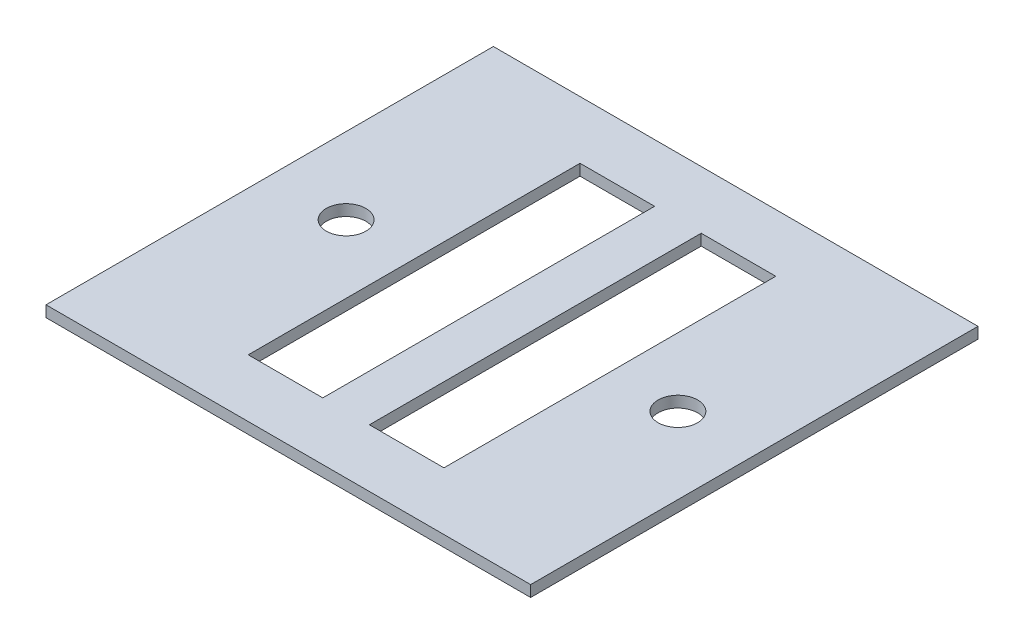
ISO-10303-21;
HEADER;
FILE_DESCRIPTION(('STEP AP214'),'2;1');
FILE_NAME('part.step','',(''),(''),'','','');
FILE_SCHEMA(('AUTOMOTIVE_DESIGN { 1 0 10303 214 1 1 1 1 }'));
ENDSEC;
DATA;
#1=APPLICATION_CONTEXT('core data for automotive mechanical design processes');
#2=APPLICATION_PROTOCOL_DEFINITION('international standard','automotive_design',2000,#1);
#3=PRODUCT_CONTEXT('',#1,'mechanical');
#4=PRODUCT('Part','Part','',(#3));
#5=PRODUCT_RELATED_PRODUCT_CATEGORY('part','',(#4));
#6=PRODUCT_DEFINITION_FORMATION('','',#4);
#7=PRODUCT_DEFINITION_CONTEXT('part definition',#1,'design');
#8=PRODUCT_DEFINITION('design','',#6,#7);
#9=PRODUCT_DEFINITION_SHAPE('','',#8);
#10=(LENGTH_UNIT() NAMED_UNIT(*) SI_UNIT(.MILLI.,.METRE.));
#11=(NAMED_UNIT(*) PLANE_ANGLE_UNIT() SI_UNIT($,.RADIAN.));
#12=(NAMED_UNIT(*) SI_UNIT($,.STERADIAN.) SOLID_ANGLE_UNIT());
#13=UNCERTAINTY_MEASURE_WITH_UNIT(LENGTH_MEASURE(1.E-05),#10,'distance_accuracy_value','');
#14=(GEOMETRIC_REPRESENTATION_CONTEXT(3) GLOBAL_UNCERTAINTY_ASSIGNED_CONTEXT((#13)) GLOBAL_UNIT_ASSIGNED_CONTEXT((#10,
#11,#12)) REPRESENTATION_CONTEXT('',''));
#15=CARTESIAN_POINT('',(0.,0.,0.));
#16=DIRECTION('',(0.,0.,1.));
#17=DIRECTION('',(1.,0.,0.));
#18=AXIS2_PLACEMENT_3D('',#15,#16,#17);
#19=CARTESIAN_POINT('',(0.,3.,0.));
#20=DIRECTION('',(0.,-1.,0.));
#21=DIRECTION('',(0.,0.,-1.));
#22=AXIS2_PLACEMENT_3D('',#19,#20,#21);
#23=PLANE('',#22);
#24=CARTESIAN_POINT('',(-44.5,3.,0.));
#25=DIRECTION('',(0.,-1.,0.));
#26=DIRECTION('',(0.,0.,-1.));
#27=AXIS2_PLACEMENT_3D('',#24,#25,#26);
#28=CIRCLE('',#27,5.3);
#29=CARTESIAN_POINT('',(-44.5,3.,-5.3));
#30=VERTEX_POINT('',#29);
#31=EDGE_CURVE('E313',#30,#30,#28,.F.);
#32=ORIENTED_EDGE('',*,*,#31,.F.);
#33=EDGE_LOOP('',(#32));
#34=FACE_BOUND('',#33,.T.);
#35=CARTESIAN_POINT('',(44.5,3.,0.));
#36=DIRECTION('',(0.,-1.,0.));
#37=DIRECTION('',(0.,0.,-1.));
#38=AXIS2_PLACEMENT_3D('',#35,#36,#37);
#39=CIRCLE('',#38,5.3);
#40=CARTESIAN_POINT('',(44.5,3.,-5.3));
#41=VERTEX_POINT('',#40);
#42=EDGE_CURVE('E138',#41,#41,#39,.T.);
#43=ORIENTED_EDGE('',*,*,#42,.T.);
#44=EDGE_LOOP('',(#43));
#45=FACE_BOUND('',#44,.T.);
#46=DIRECTION('',(0.,0.,-1.));
#47=VECTOR('',#46,1.);
#48=CARTESIAN_POINT('',(65.,3.,60.));
#49=LINE('',#48,#47);
#50=CARTESIAN_POINT('',(65.,3.,60.));
#51=VERTEX_POINT('',#50);
#52=CARTESIAN_POINT('',(65.,3.,-60.));
#53=VERTEX_POINT('',#52);
#54=EDGE_CURVE('E196',#51,#53,#49,.T.);
#55=ORIENTED_EDGE('',*,*,#54,.T.);
#56=DIRECTION('',(-1.,0.,0.));
#57=VECTOR('',#56,1.);
#58=CARTESIAN_POINT('',(-65.,3.,-60.));
#59=LINE('',#58,#57);
#60=CARTESIAN_POINT('',(-65.,3.,-60.));
#61=VERTEX_POINT('',#60);
#62=EDGE_CURVE('E199',#53,#61,#59,.T.);
#63=ORIENTED_EDGE('',*,*,#62,.T.);
#64=DIRECTION('',(0.,0.,1.));
#65=VECTOR('',#64,1.);
#66=CARTESIAN_POINT('',(-65.,3.,60.));
#67=LINE('',#66,#65);
#68=CARTESIAN_POINT('',(-65.,3.,60.));
#69=VERTEX_POINT('',#68);
#70=EDGE_CURVE('E202',#61,#69,#67,.T.);
#71=ORIENTED_EDGE('',*,*,#70,.T.);
#72=DIRECTION('',(1.,0.,0.));
#73=VECTOR('',#72,1.);
#74=CARTESIAN_POINT('',(-65.,3.,60.));
#75=LINE('',#74,#73);
#76=EDGE_CURVE('E204',#69,#51,#75,.T.);
#77=ORIENTED_EDGE('',*,*,#76,.T.);
#78=EDGE_LOOP('',(#55,#63,#71,#77));
#79=FACE_BOUND('',#78,.T.);
#80=DIRECTION('',(1.,0.,0.));
#81=VECTOR('',#80,1.);
#82=CARTESIAN_POINT('',(0.,3.,-44.5));
#83=LINE('',#82,#81);
#84=CARTESIAN_POINT('',(-26.25,3.,-44.5));
#85=VERTEX_POINT('',#84);
#86=CARTESIAN_POINT('',(-6.25,3.,-44.5));
#87=VERTEX_POINT('',#86);
#88=EDGE_CURVE('E176',#85,#87,#83,.T.);
#89=ORIENTED_EDGE('',*,*,#88,.T.);
#90=DIRECTION('',(0.,0.,1.));
#91=VECTOR('',#90,1.);
#92=CARTESIAN_POINT('',(-6.25,3.,0.));
#93=LINE('',#92,#91);
#94=CARTESIAN_POINT('',(-6.25,3.,44.5));
#95=VERTEX_POINT('',#94);
#96=EDGE_CURVE('E192',#87,#95,#93,.T.);
#97=ORIENTED_EDGE('',*,*,#96,.T.);
#98=DIRECTION('',(-1.,0.,0.));
#99=VECTOR('',#98,1.);
#100=CARTESIAN_POINT('',(0.,3.,44.5));
#101=LINE('',#100,#99);
#102=CARTESIAN_POINT('',(-26.25,3.,44.5));
#103=VERTEX_POINT('',#102);
#104=EDGE_CURVE('E189',#95,#103,#101,.T.);
#105=ORIENTED_EDGE('',*,*,#104,.T.);
#106=DIRECTION('',(0.,0.,-1.));
#107=VECTOR('',#106,1.);
#108=CARTESIAN_POINT('',(-26.25,3.,0.));
#109=LINE('',#108,#107);
#110=EDGE_CURVE('E186',#103,#85,#109,.T.);
#111=ORIENTED_EDGE('',*,*,#110,.T.);
#112=EDGE_LOOP('',(#89,#97,#105,#111));
#113=FACE_BOUND('',#112,.T.);
#114=DIRECTION('',(0.,0.,1.));
#115=VECTOR('',#114,1.);
#116=CARTESIAN_POINT('',(6.25,3.,0.));
#117=LINE('',#116,#115);
#118=CARTESIAN_POINT('',(6.25,3.,-44.5));
#119=VERTEX_POINT('',#118);
#120=CARTESIAN_POINT('',(6.25,3.,44.5));
#121=VERTEX_POINT('',#120);
#122=EDGE_CURVE('E132',#119,#121,#117,.T.);
#123=ORIENTED_EDGE('',*,*,#122,.F.);
#124=DIRECTION('',(-1.,0.,0.));
#125=VECTOR('',#124,1.);
#126=CARTESIAN_POINT('',(0.,3.,-44.5));
#127=LINE('',#126,#125);
#128=CARTESIAN_POINT('',(26.25,3.,-44.5));
#129=VERTEX_POINT('',#128);
#130=EDGE_CURVE('E157',#129,#119,#127,.T.);
#131=ORIENTED_EDGE('',*,*,#130,.F.);
#132=DIRECTION('',(0.,0.,-1.));
#133=VECTOR('',#132,1.);
#134=CARTESIAN_POINT('',(26.25,3.,0.));
#135=LINE('',#134,#133);
#136=CARTESIAN_POINT('',(26.25,3.,44.5));
#137=VERTEX_POINT('',#136);
#138=EDGE_CURVE('E155',#137,#129,#135,.T.);
#139=ORIENTED_EDGE('',*,*,#138,.F.);
#140=DIRECTION('',(1.,0.,0.));
#141=VECTOR('',#140,1.);
#142=CARTESIAN_POINT('',(0.,3.,44.5));
#143=LINE('',#142,#141);
#144=EDGE_CURVE('E149',#121,#137,#143,.T.);
#145=ORIENTED_EDGE('',*,*,#144,.F.);
#146=EDGE_LOOP('',(#123,#131,#139,#145));
#147=FACE_BOUND('',#146,.T.);
#148=ADVANCED_FACE('F33',(#34,#45,#79,#113,#147),#23,.F.);
#149=CARTESIAN_POINT('',(0.,0.,0.));
#150=DIRECTION('',(0.,-1.,0.));
#151=DIRECTION('',(0.,0.,-1.));
#152=AXIS2_PLACEMENT_3D('',#149,#150,#151);
#153=PLANE('',#152);
#154=CARTESIAN_POINT('',(-44.5,0.,0.));
#155=DIRECTION('',(0.,-1.,0.));
#156=DIRECTION('',(0.,0.,1.));
#157=AXIS2_PLACEMENT_3D('',#154,#155,#156);
#158=CIRCLE('',#157,5.3);
#159=CARTESIAN_POINT('',(-44.5,0.,5.3));
#160=VERTEX_POINT('',#159);
#161=EDGE_CURVE('E311',#160,#160,#158,.T.);
#162=ORIENTED_EDGE('',*,*,#161,.F.);
#163=EDGE_LOOP('',(#162));
#164=FACE_BOUND('',#163,.T.);
#165=CARTESIAN_POINT('',(44.5,0.,0.));
#166=DIRECTION('',(0.,1.,0.));
#167=DIRECTION('',(0.,0.,1.));
#168=AXIS2_PLACEMENT_3D('',#165,#166,#167);
#169=CIRCLE('',#168,5.3);
#170=CARTESIAN_POINT('',(44.5,0.,5.3));
#171=VERTEX_POINT('',#170);
#172=EDGE_CURVE('E141',#171,#171,#169,.T.);
#173=ORIENTED_EDGE('',*,*,#172,.T.);
#174=EDGE_LOOP('',(#173));
#175=FACE_BOUND('',#174,.T.);
#176=DIRECTION('',(0.,0.,-1.));
#177=VECTOR('',#176,1.);
#178=CARTESIAN_POINT('',(-6.25,0.,44.5));
#179=LINE('',#178,#177);
#180=CARTESIAN_POINT('',(-6.25,0.,44.5));
#181=VERTEX_POINT('',#180);
#182=CARTESIAN_POINT('',(-6.25,0.,-44.5));
#183=VERTEX_POINT('',#182);
#184=EDGE_CURVE('E160',#181,#183,#179,.T.);
#185=ORIENTED_EDGE('',*,*,#184,.T.);
#186=DIRECTION('',(-1.,0.,0.));
#187=VECTOR('',#186,1.);
#188=CARTESIAN_POINT('',(-26.25,0.,-44.5));
#189=LINE('',#188,#187);
#190=CARTESIAN_POINT('',(-26.25,0.,-44.5));
#191=VERTEX_POINT('',#190);
#192=EDGE_CURVE('E163',#183,#191,#189,.T.);
#193=ORIENTED_EDGE('',*,*,#192,.T.);
#194=DIRECTION('',(0.,0.,1.));
#195=VECTOR('',#194,1.);
#196=CARTESIAN_POINT('',(-26.25,0.,44.5));
#197=LINE('',#196,#195);
#198=CARTESIAN_POINT('',(-26.25,0.,44.5));
#199=VERTEX_POINT('',#198);
#200=EDGE_CURVE('E166',#191,#199,#197,.T.);
#201=ORIENTED_EDGE('',*,*,#200,.T.);
#202=DIRECTION('',(1.,0.,0.));
#203=VECTOR('',#202,1.);
#204=CARTESIAN_POINT('',(-26.25,0.,44.5));
#205=LINE('',#204,#203);
#206=EDGE_CURVE('E169',#199,#181,#205,.T.);
#207=ORIENTED_EDGE('',*,*,#206,.T.);
#208=EDGE_LOOP('',(#185,#193,#201,#207));
#209=FACE_BOUND('',#208,.T.);
#210=DIRECTION('',(0.,0.,-1.));
#211=VECTOR('',#210,1.);
#212=CARTESIAN_POINT('',(65.,0.,60.));
#213=LINE('',#212,#211);
#214=CARTESIAN_POINT('',(65.,0.,60.));
#215=VERTEX_POINT('',#214);
#216=CARTESIAN_POINT('',(65.,0.,-60.));
#217=VERTEX_POINT('',#216);
#218=EDGE_CURVE('E195',#215,#217,#213,.T.);
#219=ORIENTED_EDGE('',*,*,#218,.F.);
#220=DIRECTION('',(1.,0.,0.));
#221=VECTOR('',#220,1.);
#222=CARTESIAN_POINT('',(-65.,0.,60.));
#223=LINE('',#222,#221);
#224=CARTESIAN_POINT('',(-65.,0.,60.));
#225=VERTEX_POINT('',#224);
#226=EDGE_CURVE('E200',#225,#215,#223,.T.);
#227=ORIENTED_EDGE('',*,*,#226,.F.);
#228=DIRECTION('',(0.,0.,1.));
#229=VECTOR('',#228,1.);
#230=CARTESIAN_POINT('',(-65.,0.,60.));
#231=LINE('',#230,#229);
#232=CARTESIAN_POINT('',(-65.,0.,-60.));
#233=VERTEX_POINT('',#232);
#234=EDGE_CURVE('E211',#233,#225,#231,.T.);
#235=ORIENTED_EDGE('',*,*,#234,.F.);
#236=DIRECTION('',(-1.,0.,0.));
#237=VECTOR('',#236,1.);
#238=CARTESIAN_POINT('',(-65.,0.,-60.));
#239=LINE('',#238,#237);
#240=EDGE_CURVE('E209',#217,#233,#239,.T.);
#241=ORIENTED_EDGE('',*,*,#240,.F.);
#242=EDGE_LOOP('',(#219,#227,#235,#241));
#243=FACE_BOUND('',#242,.T.);
#244=DIRECTION('',(1.,0.,0.));
#245=VECTOR('',#244,1.);
#246=CARTESIAN_POINT('',(26.25,0.,-44.5));
#247=LINE('',#246,#245);
#248=CARTESIAN_POINT('',(6.25,0.,-44.5));
#249=VERTEX_POINT('',#248);
#250=CARTESIAN_POINT('',(26.25,0.,-44.5));
#251=VERTEX_POINT('',#250);
#252=EDGE_CURVE('E134',#249,#251,#247,.T.);
#253=ORIENTED_EDGE('',*,*,#252,.F.);
#254=DIRECTION('',(0.,0.,-1.));
#255=VECTOR('',#254,1.);
#256=CARTESIAN_POINT('',(6.25,0.,44.5));
#257=LINE('',#256,#255);
#258=CARTESIAN_POINT('',(6.25,0.,44.5));
#259=VERTEX_POINT('',#258);
#260=EDGE_CURVE('E125',#259,#249,#257,.T.);
#261=ORIENTED_EDGE('',*,*,#260,.F.);
#262=DIRECTION('',(-1.,0.,0.));
#263=VECTOR('',#262,1.);
#264=CARTESIAN_POINT('',(26.25,0.,44.5));
#265=LINE('',#264,#263);
#266=CARTESIAN_POINT('',(26.25,0.,44.5));
#267=VERTEX_POINT('',#266);
#268=EDGE_CURVE('E119',#267,#259,#265,.T.);
#269=ORIENTED_EDGE('',*,*,#268,.F.);
#270=DIRECTION('',(0.,0.,1.));
#271=VECTOR('',#270,1.);
#272=CARTESIAN_POINT('',(26.25,0.,44.5));
#273=LINE('',#272,#271);
#274=EDGE_CURVE('E124',#251,#267,#273,.T.);
#275=ORIENTED_EDGE('',*,*,#274,.F.);
#276=EDGE_LOOP('',(#253,#261,#269,#275));
#277=FACE_BOUND('',#276,.T.);
#278=ADVANCED_FACE('F137',(#164,#175,#209,#243,#277),#153,.T.);
#279=CARTESIAN_POINT('',(65.,3.,60.));
#280=DIRECTION('',(-1.,0.,0.));
#281=DIRECTION('',(0.,0.,1.));
#282=AXIS2_PLACEMENT_3D('',#279,#280,#281);
#283=PLANE('',#282);
#284=ORIENTED_EDGE('',*,*,#218,.T.);
#285=DIRECTION('',(0.,-1.,0.));
#286=VECTOR('',#285,1.);
#287=CARTESIAN_POINT('',(65.,3.,-60.));
#288=LINE('',#287,#286);
#289=EDGE_CURVE('E11',#53,#217,#288,.T.);
#290=ORIENTED_EDGE('',*,*,#289,.F.);
#291=ORIENTED_EDGE('',*,*,#54,.F.);
#292=DIRECTION('',(0.,-1.,0.));
#293=VECTOR('',#292,1.);
#294=CARTESIAN_POINT('',(65.,3.,60.));
#295=LINE('',#294,#293);
#296=EDGE_CURVE('E206',#51,#215,#295,.T.);
#297=ORIENTED_EDGE('',*,*,#296,.T.);
#298=EDGE_LOOP('',(#284,#290,#291,#297));
#299=FACE_BOUND('',#298,.T.);
#300=ADVANCED_FACE('F35',(#299),#283,.F.);
#301=CARTESIAN_POINT('',(-65.,3.,-60.));
#302=DIRECTION('',(0.,0.,1.));
#303=DIRECTION('',(1.,0.,0.));
#304=AXIS2_PLACEMENT_3D('',#301,#302,#303);
#305=PLANE('',#304);
#306=ORIENTED_EDGE('',*,*,#240,.T.);
#307=DIRECTION('',(0.,-1.,0.));
#308=VECTOR('',#307,1.);
#309=CARTESIAN_POINT('',(-65.,3.,-60.));
#310=LINE('',#309,#308);
#311=EDGE_CURVE('E41',#61,#233,#310,.T.);
#312=ORIENTED_EDGE('',*,*,#311,.F.);
#313=ORIENTED_EDGE('',*,*,#62,.F.);
#314=ORIENTED_EDGE('',*,*,#289,.T.);
#315=EDGE_LOOP('',(#306,#312,#313,#314));
#316=FACE_BOUND('',#315,.T.);
#317=ADVANCED_FACE('F238',(#316),#305,.F.);
#318=CARTESIAN_POINT('',(-65.,3.,60.));
#319=DIRECTION('',(1.,0.,0.));
#320=DIRECTION('',(0.,0.,-1.));
#321=AXIS2_PLACEMENT_3D('',#318,#319,#320);
#322=PLANE('',#321);
#323=ORIENTED_EDGE('',*,*,#234,.T.);
#324=DIRECTION('',(0.,-1.,0.));
#325=VECTOR('',#324,1.);
#326=CARTESIAN_POINT('',(-65.,3.,60.));
#327=LINE('',#326,#325);
#328=EDGE_CURVE('E216',#69,#225,#327,.T.);
#329=ORIENTED_EDGE('',*,*,#328,.F.);
#330=ORIENTED_EDGE('',*,*,#70,.F.);
#331=ORIENTED_EDGE('',*,*,#311,.T.);
#332=EDGE_LOOP('',(#323,#329,#330,#331));
#333=FACE_BOUND('',#332,.T.);
#334=ADVANCED_FACE('F223',(#333),#322,.F.);
#335=CARTESIAN_POINT('',(-65.,3.,60.));
#336=DIRECTION('',(0.,0.,-1.));
#337=DIRECTION('',(-1.,0.,0.));
#338=AXIS2_PLACEMENT_3D('',#335,#336,#337);
#339=PLANE('',#338);
#340=ORIENTED_EDGE('',*,*,#226,.T.);
#341=ORIENTED_EDGE('',*,*,#296,.F.);
#342=ORIENTED_EDGE('',*,*,#76,.F.);
#343=ORIENTED_EDGE('',*,*,#328,.T.);
#344=EDGE_LOOP('',(#340,#341,#342,#343));
#345=FACE_BOUND('',#344,.T.);
#346=ADVANCED_FACE('F231',(#345),#339,.F.);
#347=CARTESIAN_POINT('',(-6.25,0.,44.5));
#348=DIRECTION('',(1.,0.,0.));
#349=DIRECTION('',(0.,0.,-1.));
#350=AXIS2_PLACEMENT_3D('',#347,#348,#349);
#351=PLANE('',#350);
#352=DIRECTION('',(0.,1.,0.));
#353=VECTOR('',#352,1.);
#354=CARTESIAN_POINT('',(-6.25,0.,-44.5));
#355=LINE('',#354,#353);
#356=EDGE_CURVE('E172',#183,#87,#355,.T.);
#357=ORIENTED_EDGE('',*,*,#356,.F.);
#358=ORIENTED_EDGE('',*,*,#184,.F.);
#359=DIRECTION('',(0.,1.,0.));
#360=VECTOR('',#359,1.);
#361=CARTESIAN_POINT('',(-6.25,0.,44.5));
#362=LINE('',#361,#360);
#363=EDGE_CURVE('E173',#181,#95,#362,.T.);
#364=ORIENTED_EDGE('',*,*,#363,.T.);
#365=ORIENTED_EDGE('',*,*,#96,.F.);
#366=EDGE_LOOP('',(#357,#358,#364,#365));
#367=FACE_BOUND('',#366,.T.);
#368=ADVANCED_FACE('F256',(#367),#351,.F.);
#369=CARTESIAN_POINT('',(-26.25,0.,44.5));
#370=DIRECTION('',(0.,0.,1.));
#371=DIRECTION('',(1.,0.,0.));
#372=AXIS2_PLACEMENT_3D('',#369,#370,#371);
#373=PLANE('',#372);
#374=ORIENTED_EDGE('',*,*,#363,.F.);
#375=ORIENTED_EDGE('',*,*,#206,.F.);
#376=DIRECTION('',(0.,1.,0.));
#377=VECTOR('',#376,1.);
#378=CARTESIAN_POINT('',(-26.25,0.,44.5));
#379=LINE('',#378,#377);
#380=EDGE_CURVE('E177',#199,#103,#379,.T.);
#381=ORIENTED_EDGE('',*,*,#380,.T.);
#382=ORIENTED_EDGE('',*,*,#104,.F.);
#383=EDGE_LOOP('',(#374,#375,#381,#382));
#384=FACE_BOUND('',#383,.T.);
#385=ADVANCED_FACE('F263',(#384),#373,.F.);
#386=CARTESIAN_POINT('',(-26.25,0.,44.5));
#387=DIRECTION('',(-1.,0.,0.));
#388=DIRECTION('',(0.,0.,1.));
#389=AXIS2_PLACEMENT_3D('',#386,#387,#388);
#390=PLANE('',#389);
#391=ORIENTED_EDGE('',*,*,#380,.F.);
#392=ORIENTED_EDGE('',*,*,#200,.F.);
#393=DIRECTION('',(0.,1.,0.));
#394=VECTOR('',#393,1.);
#395=CARTESIAN_POINT('',(-26.25,0.,-44.5));
#396=LINE('',#395,#394);
#397=EDGE_CURVE('E180',#191,#85,#396,.T.);
#398=ORIENTED_EDGE('',*,*,#397,.T.);
#399=ORIENTED_EDGE('',*,*,#110,.F.);
#400=EDGE_LOOP('',(#391,#392,#398,#399));
#401=FACE_BOUND('',#400,.T.);
#402=ADVANCED_FACE('F268',(#401),#390,.F.);
#403=CARTESIAN_POINT('',(-26.25,0.,-44.5));
#404=DIRECTION('',(0.,0.,-1.));
#405=DIRECTION('',(-1.,0.,0.));
#406=AXIS2_PLACEMENT_3D('',#403,#404,#405);
#407=PLANE('',#406);
#408=ORIENTED_EDGE('',*,*,#397,.F.);
#409=ORIENTED_EDGE('',*,*,#192,.F.);
#410=ORIENTED_EDGE('',*,*,#356,.T.);
#411=ORIENTED_EDGE('',*,*,#88,.F.);
#412=EDGE_LOOP('',(#408,#409,#410,#411));
#413=FACE_BOUND('',#412,.T.);
#414=ADVANCED_FACE('F276',(#413),#407,.F.);
#415=CARTESIAN_POINT('',(6.25,0.,44.5));
#416=DIRECTION('',(1.,0.,0.));
#417=DIRECTION('',(0.,0.,-1.));
#418=AXIS2_PLACEMENT_3D('',#415,#416,#417);
#419=PLANE('',#418);
#420=ORIENTED_EDGE('',*,*,#122,.T.);
#421=DIRECTION('',(0.,1.,0.));
#422=VECTOR('',#421,1.);
#423=CARTESIAN_POINT('',(6.25,0.,44.5));
#424=LINE('',#423,#422);
#425=EDGE_CURVE('E48',#259,#121,#424,.T.);
#426=ORIENTED_EDGE('',*,*,#425,.F.);
#427=ORIENTED_EDGE('',*,*,#260,.T.);
#428=DIRECTION('',(0.,1.,0.));
#429=VECTOR('',#428,1.);
#430=CARTESIAN_POINT('',(6.25,0.,-44.5));
#431=LINE('',#430,#429);
#432=EDGE_CURVE('E147',#249,#119,#431,.T.);
#433=ORIENTED_EDGE('',*,*,#432,.T.);
#434=EDGE_LOOP('',(#420,#426,#427,#433));
#435=FACE_BOUND('',#434,.T.);
#436=ADVANCED_FACE('F128',(#435),#419,.T.);
#437=CARTESIAN_POINT('',(26.25,0.,-44.5));
#438=DIRECTION('',(0.,0.,1.));
#439=DIRECTION('',(1.,0.,0.));
#440=AXIS2_PLACEMENT_3D('',#437,#438,#439);
#441=PLANE('',#440);
#442=ORIENTED_EDGE('',*,*,#130,.T.);
#443=ORIENTED_EDGE('',*,*,#432,.F.);
#444=ORIENTED_EDGE('',*,*,#252,.T.);
#445=DIRECTION('',(0.,1.,0.));
#446=VECTOR('',#445,1.);
#447=CARTESIAN_POINT('',(26.25,0.,-44.5));
#448=LINE('',#447,#446);
#449=EDGE_CURVE('E150',#251,#129,#448,.T.);
#450=ORIENTED_EDGE('',*,*,#449,.T.);
#451=EDGE_LOOP('',(#442,#443,#444,#450));
#452=FACE_BOUND('',#451,.T.);
#453=ADVANCED_FACE('F289',(#452),#441,.T.);
#454=CARTESIAN_POINT('',(26.25,0.,44.5));
#455=DIRECTION('',(-1.,0.,0.));
#456=DIRECTION('',(0.,0.,1.));
#457=AXIS2_PLACEMENT_3D('',#454,#455,#456);
#458=PLANE('',#457);
#459=ORIENTED_EDGE('',*,*,#138,.T.);
#460=ORIENTED_EDGE('',*,*,#449,.F.);
#461=ORIENTED_EDGE('',*,*,#274,.T.);
#462=DIRECTION('',(0.,1.,0.));
#463=VECTOR('',#462,1.);
#464=CARTESIAN_POINT('',(26.25,0.,44.5));
#465=LINE('',#464,#463);
#466=EDGE_CURVE('E53',#267,#137,#465,.T.);
#467=ORIENTED_EDGE('',*,*,#466,.T.);
#468=EDGE_LOOP('',(#459,#460,#461,#467));
#469=FACE_BOUND('',#468,.T.);
#470=ADVANCED_FACE('F293',(#469),#458,.T.);
#471=CARTESIAN_POINT('',(26.25,0.,44.5));
#472=DIRECTION('',(0.,0.,-1.));
#473=DIRECTION('',(-1.,0.,0.));
#474=AXIS2_PLACEMENT_3D('',#471,#472,#473);
#475=PLANE('',#474);
#476=ORIENTED_EDGE('',*,*,#144,.T.);
#477=ORIENTED_EDGE('',*,*,#466,.F.);
#478=ORIENTED_EDGE('',*,*,#268,.T.);
#479=ORIENTED_EDGE('',*,*,#425,.T.);
#480=EDGE_LOOP('',(#476,#477,#478,#479));
#481=FACE_BOUND('',#480,.T.);
#482=ADVANCED_FACE('F120',(#481),#475,.T.);
#483=CARTESIAN_POINT('',(44.5,0.,0.));
#484=DIRECTION('',(0.,1.,0.));
#485=DIRECTION('',(0.,0.,1.));
#486=AXIS2_PLACEMENT_3D('',#483,#484,#485);
#487=CYLINDRICAL_SURFACE('',#486,5.3);
#488=ORIENTED_EDGE('',*,*,#172,.F.);
#489=EDGE_LOOP('',(#488));
#490=FACE_BOUND('',#489,.T.);
#491=ORIENTED_EDGE('',*,*,#42,.F.);
#492=EDGE_LOOP('',(#491));
#493=FACE_BOUND('',#492,.T.);
#494=ADVANCED_FACE('F292',(#490,#493),#487,.F.);
#495=CARTESIAN_POINT('',(-44.5,0.,0.));
#496=DIRECTION('',(0.,1.,0.));
#497=DIRECTION('',(0.,0.,1.));
#498=AXIS2_PLACEMENT_3D('',#495,#496,#497);
#499=CYLINDRICAL_SURFACE('',#498,5.3);
#500=ORIENTED_EDGE('',*,*,#161,.T.);
#501=EDGE_LOOP('',(#500));
#502=FACE_BOUND('',#501,.T.);
#503=ORIENTED_EDGE('',*,*,#31,.T.);
#504=EDGE_LOOP('',(#503));
#505=FACE_BOUND('',#504,.T.);
#506=ADVANCED_FACE('F302',(#502,#505),#499,.F.);
#507=CLOSED_SHELL('',(#148,#278,#300,#317,#334,#346,#368,#385,#402,#414,#436,#453,#470,#482,
#494,#506));
#508=MANIFOLD_SOLID_BREP('B2',#507);
#509=ADVANCED_BREP_SHAPE_REPRESENTATION('',(#18,#508),#14);
#510=SHAPE_DEFINITION_REPRESENTATION(#9,#509);
ENDSEC;
END-ISO-10303-21;
